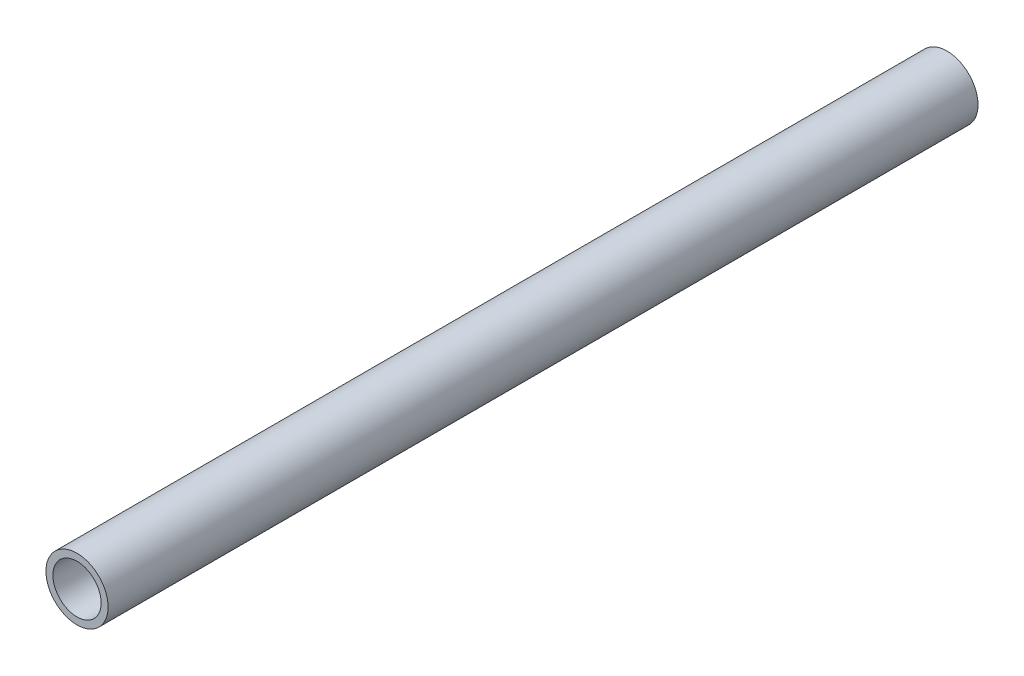
ISO-10303-21;
HEADER;
FILE_DESCRIPTION(('STEP AP214'),'2;1');
FILE_NAME('part.step','',(''),(''),'','','');
FILE_SCHEMA(('AUTOMOTIVE_DESIGN { 1 0 10303 214 1 1 1 1 }'));
ENDSEC;
DATA;
#1=APPLICATION_CONTEXT('core data for automotive mechanical design processes');
#2=APPLICATION_PROTOCOL_DEFINITION('international standard','automotive_design',2000,#1);
#3=PRODUCT_CONTEXT('',#1,'mechanical');
#4=PRODUCT('Part','Part','',(#3));
#5=PRODUCT_RELATED_PRODUCT_CATEGORY('part','',(#4));
#6=PRODUCT_DEFINITION_FORMATION('','',#4);
#7=PRODUCT_DEFINITION_CONTEXT('part definition',#1,'design');
#8=PRODUCT_DEFINITION('design','',#6,#7);
#9=PRODUCT_DEFINITION_SHAPE('','',#8);
#10=(LENGTH_UNIT() NAMED_UNIT(*) SI_UNIT(.MILLI.,.METRE.));
#11=(NAMED_UNIT(*) PLANE_ANGLE_UNIT() SI_UNIT($,.RADIAN.));
#12=(NAMED_UNIT(*) SI_UNIT($,.STERADIAN.) SOLID_ANGLE_UNIT());
#13=UNCERTAINTY_MEASURE_WITH_UNIT(LENGTH_MEASURE(1.E-05),#10,'distance_accuracy_value','');
#14=(GEOMETRIC_REPRESENTATION_CONTEXT(3) GLOBAL_UNCERTAINTY_ASSIGNED_CONTEXT((#13)) GLOBAL_UNIT_ASSIGNED_CONTEXT((#10,
#11,#12)) REPRESENTATION_CONTEXT('',''));
#15=CARTESIAN_POINT('',(0.,0.,0.));
#16=DIRECTION('',(0.,0.,1.));
#17=DIRECTION('',(1.,0.,0.));
#18=AXIS2_PLACEMENT_3D('',#15,#16,#17);
#19=CARTESIAN_POINT('',(0.,0.,175.));
#20=DIRECTION('',(0.,0.,1.));
#21=DIRECTION('',(1.,0.,0.));
#22=AXIS2_PLACEMENT_3D('',#19,#20,#21);
#23=PLANE('',#22);
#24=CARTESIAN_POINT('',(0.,0.,175.));
#25=DIRECTION('',(0.,0.,1.));
#26=DIRECTION('',(1.,0.,0.));
#27=AXIS2_PLACEMENT_3D('',#24,#25,#26);
#28=CIRCLE('',#27,12.5);
#29=CARTESIAN_POINT('',(12.5,0.,175.));
#30=VERTEX_POINT('',#29);
#31=EDGE_CURVE('E10',#30,#30,#28,.T.);
#32=ORIENTED_EDGE('',*,*,#31,.T.);
#33=EDGE_LOOP('',(#32));
#34=FACE_BOUND('',#33,.T.);
#35=CARTESIAN_POINT('',(0.,0.,175.));
#36=DIRECTION('',(0.,0.,1.));
#37=DIRECTION('',(1.,0.,0.));
#38=AXIS2_PLACEMENT_3D('',#35,#36,#37);
#39=CIRCLE('',#38,9.7);
#40=CARTESIAN_POINT('',(9.7,0.,175.));
#41=VERTEX_POINT('',#40);
#42=EDGE_CURVE('E44',#41,#41,#39,.T.);
#43=ORIENTED_EDGE('',*,*,#42,.F.);
#44=EDGE_LOOP('',(#43));
#45=FACE_BOUND('',#44,.T.);
#46=ADVANCED_FACE('F33',(#34,#45),#23,.T.);
#47=CARTESIAN_POINT('',(0.,0.,-175.));
#48=DIRECTION('',(0.,0.,1.));
#49=DIRECTION('',(1.,0.,0.));
#50=AXIS2_PLACEMENT_3D('',#47,#48,#49);
#51=PLANE('',#50);
#52=CARTESIAN_POINT('',(0.,0.,-175.));
#53=DIRECTION('',(0.,0.,1.));
#54=DIRECTION('',(1.,0.,0.));
#55=AXIS2_PLACEMENT_3D('',#52,#53,#54);
#56=CIRCLE('',#55,12.5);
#57=CARTESIAN_POINT('',(12.5,0.,-175.));
#58=VERTEX_POINT('',#57);
#59=EDGE_CURVE('E37',#58,#58,#56,.T.);
#60=ORIENTED_EDGE('',*,*,#59,.F.);
#61=EDGE_LOOP('',(#60));
#62=FACE_BOUND('',#61,.T.);
#63=CARTESIAN_POINT('',(0.,0.,-175.));
#64=DIRECTION('',(0.,0.,1.));
#65=DIRECTION('',(1.,0.,0.));
#66=AXIS2_PLACEMENT_3D('',#63,#64,#65);
#67=CIRCLE('',#66,9.7);
#68=CARTESIAN_POINT('',(9.7,0.,-175.));
#69=VERTEX_POINT('',#68);
#70=EDGE_CURVE('E46',#69,#69,#67,.T.);
#71=ORIENTED_EDGE('',*,*,#70,.T.);
#72=EDGE_LOOP('',(#71));
#73=FACE_BOUND('',#72,.T.);
#74=ADVANCED_FACE('F56',(#62,#73),#51,.F.);
#75=CARTESIAN_POINT('',(0.,0.,175.));
#76=DIRECTION('',(0.,0.,-1.));
#77=DIRECTION('',(-1.,0.,0.));
#78=AXIS2_PLACEMENT_3D('',#75,#76,#77);
#79=CYLINDRICAL_SURFACE('',#78,12.5);
#80=ORIENTED_EDGE('',*,*,#31,.F.);
#81=EDGE_LOOP('',(#80));
#82=FACE_BOUND('',#81,.T.);
#83=ORIENTED_EDGE('',*,*,#59,.T.);
#84=EDGE_LOOP('',(#83));
#85=FACE_BOUND('',#84,.T.);
#86=ADVANCED_FACE('F35',(#82,#85),#79,.T.);
#87=CARTESIAN_POINT('',(0.,0.,175.));
#88=DIRECTION('',(0.,0.,-1.));
#89=DIRECTION('',(-1.,0.,0.));
#90=AXIS2_PLACEMENT_3D('',#87,#88,#89);
#91=CYLINDRICAL_SURFACE('',#90,9.7);
#92=ORIENTED_EDGE('',*,*,#42,.T.);
#93=EDGE_LOOP('',(#92));
#94=FACE_BOUND('',#93,.T.);
#95=ORIENTED_EDGE('',*,*,#70,.F.);
#96=EDGE_LOOP('',(#95));
#97=FACE_BOUND('',#96,.T.);
#98=ADVANCED_FACE('F52',(#94,#97),#91,.F.);
#99=CLOSED_SHELL('',(#46,#74,#86,#98));
#100=MANIFOLD_SOLID_BREP('B2',#99);
#101=ADVANCED_BREP_SHAPE_REPRESENTATION('',(#18,#100),#14);
#102=SHAPE_DEFINITION_REPRESENTATION(#9,#101);
ENDSEC;
END-ISO-10303-21;
